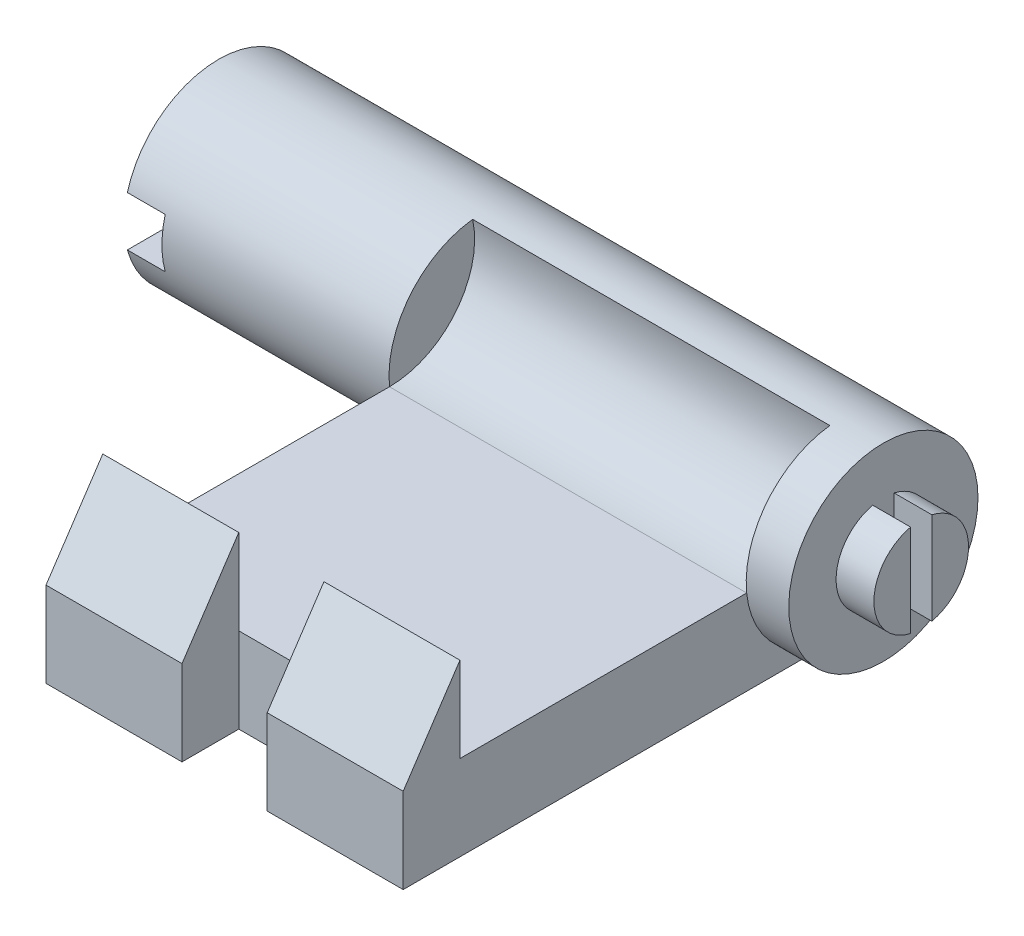
ISO-10303-21;
HEADER;
FILE_DESCRIPTION(('STEP AP214'),'2;1');
FILE_NAME('part.step','',(''),(''),'','','');
FILE_SCHEMA(('AUTOMOTIVE_DESIGN { 1 0 10303 214 1 1 1 1 }'));
ENDSEC;
DATA;
#1=APPLICATION_CONTEXT('core data for automotive mechanical design processes');
#2=APPLICATION_PROTOCOL_DEFINITION('international standard','automotive_design',2000,#1);
#3=PRODUCT_CONTEXT('',#1,'mechanical');
#4=PRODUCT('Part','Part','',(#3));
#5=PRODUCT_RELATED_PRODUCT_CATEGORY('part','',(#4));
#6=PRODUCT_DEFINITION_FORMATION('','',#4);
#7=PRODUCT_DEFINITION_CONTEXT('part definition',#1,'design');
#8=PRODUCT_DEFINITION('design','',#6,#7);
#9=PRODUCT_DEFINITION_SHAPE('','',#8);
#10=(LENGTH_UNIT() NAMED_UNIT(*) SI_UNIT(.MILLI.,.METRE.));
#11=(NAMED_UNIT(*) PLANE_ANGLE_UNIT() SI_UNIT($,.RADIAN.));
#12=(NAMED_UNIT(*) SI_UNIT($,.STERADIAN.) SOLID_ANGLE_UNIT());
#13=UNCERTAINTY_MEASURE_WITH_UNIT(LENGTH_MEASURE(1.E-05),#10,'distance_accuracy_value','');
#14=(GEOMETRIC_REPRESENTATION_CONTEXT(3) GLOBAL_UNCERTAINTY_ASSIGNED_CONTEXT((#13)) GLOBAL_UNIT_ASSIGNED_CONTEXT((#10,
#11,#12)) REPRESENTATION_CONTEXT('',''));
#15=CARTESIAN_POINT('',(0.,0.,0.));
#16=DIRECTION('',(0.,0.,1.));
#17=DIRECTION('',(1.,0.,0.));
#18=AXIS2_PLACEMENT_3D('',#15,#16,#17);
#19=CARTESIAN_POINT('',(38.354,0.,81.788));
#20=DIRECTION('',(0.,0.,-1.));
#21=DIRECTION('',(-1.,0.,0.));
#22=AXIS2_PLACEMENT_3D('',#19,#20,#21);
#23=PLANE('',#22);
#24=DIRECTION('',(-1.,0.,0.));
#25=VECTOR('',#24,1.);
#26=CARTESIAN_POINT('',(38.354,18.288,81.788));
#27=LINE('',#26,#25);
#28=CARTESIAN_POINT('',(38.354,18.288,81.788));
#29=VERTEX_POINT('',#28);
#30=CARTESIAN_POINT('',(9.14400000000001,18.288,81.788));
#31=VERTEX_POINT('',#30);
#32=EDGE_CURVE('E202',#29,#31,#27,.T.);
#33=ORIENTED_EDGE('',*,*,#32,.T.);
#34=DIRECTION('',(0.,1.,0.));
#35=VECTOR('',#34,1.);
#36=CARTESIAN_POINT('',(9.14400000000001,-5.00000000118461E-05,81.788));
#37=LINE('',#36,#35);
#38=CARTESIAN_POINT('',(9.14400000000001,36.576,81.788));
#39=VERTEX_POINT('',#38);
#40=EDGE_CURVE('E265',#31,#39,#37,.T.);
#41=ORIENTED_EDGE('',*,*,#40,.T.);
#42=DIRECTION('',(-1.,0.,0.));
#43=VECTOR('',#42,1.);
#44=CARTESIAN_POINT('',(38.354,36.576,81.788));
#45=LINE('',#44,#43);
#46=CARTESIAN_POINT('',(38.354,36.576,81.788));
#47=VERTEX_POINT('',#46);
#48=EDGE_CURVE('E203',#47,#39,#45,.T.);
#49=ORIENTED_EDGE('',*,*,#48,.F.);
#50=DIRECTION('',(0.,-1.,0.));
#51=VECTOR('',#50,1.);
#52=CARTESIAN_POINT('',(38.354,0.,81.788));
#53=LINE('',#52,#51);
#54=EDGE_CURVE('E328',#47,#29,#53,.T.);
#55=ORIENTED_EDGE('',*,*,#54,.T.);
#56=EDGE_LOOP('',(#33,#41,#49,#55));
#57=FACE_BOUND('',#56,.T.);
#58=ADVANCED_FACE('F35',(#57),#23,.T.);
#59=CARTESIAN_POINT('',(38.354,49.0024615384615,73.5036923076923));
#60=DIRECTION('',(0.,0.554700196225229,0.832050294337844));
#61=DIRECTION('',(0.,-0.832050294337844,0.554700196225229));
#62=AXIS2_PLACEMENT_3D('',#59,#60,#61);
#63=PLANE('',#62);
#64=ORIENTED_EDGE('',*,*,#48,.T.);
#65=DIRECTION('',(0.,-0.832050294337844,0.554700196225229));
#66=VECTOR('',#65,1.);
#67=CARTESIAN_POINT('',(9.14400000000001,49.0024615384615,73.5036923076923));
#68=LINE('',#67,#66);
#69=CARTESIAN_POINT('',(9.14400000000001,18.288,93.98));
#70=VERTEX_POINT('',#69);
#71=EDGE_CURVE('E270',#39,#70,#68,.T.);
#72=ORIENTED_EDGE('',*,*,#71,.T.);
#73=DIRECTION('',(-1.,0.,0.));
#74=VECTOR('',#73,1.);
#75=CARTESIAN_POINT('',(38.354,18.288,93.98));
#76=LINE('',#75,#74);
#77=CARTESIAN_POINT('',(38.354,18.288,93.98));
#78=VERTEX_POINT('',#77);
#79=EDGE_CURVE('E348',#78,#70,#76,.T.);
#80=ORIENTED_EDGE('',*,*,#79,.F.);
#81=DIRECTION('',(0.,0.832050294337844,-0.554700196225229));
#82=VECTOR('',#81,1.);
#83=CARTESIAN_POINT('',(38.354,49.0024615384615,73.5036923076923));
#84=LINE('',#83,#82);
#85=EDGE_CURVE('E332',#78,#47,#84,.T.);
#86=ORIENTED_EDGE('',*,*,#85,.T.);
#87=EDGE_LOOP('',(#64,#72,#80,#86));
#88=FACE_BOUND('',#87,.T.);
#89=ADVANCED_FACE('F428',(#88),#63,.T.);
#90=CARTESIAN_POINT('',(38.354,0.,93.98));
#91=DIRECTION('',(0.,0.,1.));
#92=DIRECTION('',(1.,0.,0.));
#93=AXIS2_PLACEMENT_3D('',#90,#91,#92);
#94=PLANE('',#93);
#95=ORIENTED_EDGE('',*,*,#79,.T.);
#96=DIRECTION('',(0.,1.,0.));
#97=VECTOR('',#96,1.);
#98=CARTESIAN_POINT('',(9.14400000000001,-5.00000000153156E-05,93.98));
#99=LINE('',#98,#97);
#100=CARTESIAN_POINT('',(9.14400000000001,0.,93.98));
#101=VERTEX_POINT('',#100);
#102=EDGE_CURVE('E180',#101,#70,#99,.T.);
#103=ORIENTED_EDGE('',*,*,#102,.F.);
#104=DIRECTION('',(-1.,0.,0.));
#105=VECTOR('',#104,1.);
#106=CARTESIAN_POINT('',(38.354,0.,93.98));
#107=LINE('',#106,#105);
#108=CARTESIAN_POINT('',(38.354,0.,93.98));
#109=VERTEX_POINT('',#108);
#110=EDGE_CURVE('E346',#109,#101,#107,.T.);
#111=ORIENTED_EDGE('',*,*,#110,.F.);
#112=DIRECTION('',(0.,1.,0.));
#113=VECTOR('',#112,1.);
#114=CARTESIAN_POINT('',(38.354,0.,93.98));
#115=LINE('',#114,#113);
#116=EDGE_CURVE('E236',#109,#78,#115,.T.);
#117=ORIENTED_EDGE('',*,*,#116,.T.);
#118=EDGE_LOOP('',(#95,#103,#111,#117));
#119=FACE_BOUND('',#118,.T.);
#120=ADVANCED_FACE('F433',(#119),#94,.T.);
#121=CARTESIAN_POINT('',(38.354,0.,0.));
#122=DIRECTION('',(0.,-1.,0.));
#123=DIRECTION('',(0.,0.,-1.));
#124=AXIS2_PLACEMENT_3D('',#121,#122,#123);
#125=PLANE('',#124);
#126=ORIENTED_EDGE('',*,*,#110,.T.);
#127=DIRECTION('',(0.,0.,-1.));
#128=VECTOR('',#127,1.);
#129=CARTESIAN_POINT('',(9.14400000000001,0.,0.));
#130=LINE('',#129,#128);
#131=CARTESIAN_POINT('',(9.14400000000001,0.,81.788));
#132=VERTEX_POINT('',#131);
#133=EDGE_CURVE('E11',#101,#132,#130,.T.);
#134=ORIENTED_EDGE('',*,*,#133,.T.);
#135=DIRECTION('',(-1.,0.,0.));
#136=VECTOR('',#135,1.);
#137=CARTESIAN_POINT('',(38.354,0.,81.788));
#138=LINE('',#137,#136);
#139=CARTESIAN_POINT('',(-9.14399999999999,0.,81.788));
#140=VERTEX_POINT('',#139);
#141=EDGE_CURVE('E250',#132,#140,#138,.T.);
#142=ORIENTED_EDGE('',*,*,#141,.T.);
#143=DIRECTION('',(0.,0.,-1.));
#144=VECTOR('',#143,1.);
#145=CARTESIAN_POINT('',(-9.14399999999999,0.,0.));
#146=LINE('',#145,#144);
#147=CARTESIAN_POINT('',(-9.14399999999999,0.,93.98));
#148=VERTEX_POINT('',#147);
#149=EDGE_CURVE('E43',#148,#140,#146,.T.);
#150=ORIENTED_EDGE('',*,*,#149,.F.);
#151=CARTESIAN_POINT('',(-38.354,0.,93.98));
#152=VERTEX_POINT('',#151);
#153=EDGE_CURVE('E229',#148,#152,#107,.T.);
#154=ORIENTED_EDGE('',*,*,#153,.T.);
#155=DIRECTION('',(0.,0.,1.));
#156=VECTOR('',#155,1.);
#157=CARTESIAN_POINT('',(-38.354,0.,0.));
#158=LINE('',#157,#156);
#159=CARTESIAN_POINT('',(-38.354,0.,0.));
#160=VERTEX_POINT('',#159);
#161=EDGE_CURVE('E251',#160,#152,#158,.T.);
#162=ORIENTED_EDGE('',*,*,#161,.F.);
#163=DIRECTION('',(-1.,0.,0.));
#164=VECTOR('',#163,1.);
#165=CARTESIAN_POINT('',(38.354,0.,0.));
#166=LINE('',#165,#164);
#167=CARTESIAN_POINT('',(38.354,0.,0.));
#168=VERTEX_POINT('',#167);
#169=EDGE_CURVE('E226',#168,#160,#166,.T.);
#170=ORIENTED_EDGE('',*,*,#169,.F.);
#171=DIRECTION('',(0.,0.,1.));
#172=VECTOR('',#171,1.);
#173=CARTESIAN_POINT('',(38.354,0.,0.));
#174=LINE('',#173,#172);
#175=EDGE_CURVE('E233',#168,#109,#174,.T.);
#176=ORIENTED_EDGE('',*,*,#175,.T.);
#177=EDGE_LOOP('',(#126,#134,#142,#150,#154,#162,#170,#176));
#178=FACE_BOUND('',#177,.T.);
#179=ADVANCED_FACE('F259',(#178),#125,.T.);
#180=CARTESIAN_POINT('',(38.354,20.32,0.));
#181=DIRECTION('',(-1.,0.,0.));
#182=DIRECTION('',(0.,0.,1.));
#183=AXIS2_PLACEMENT_3D('',#180,#181,#182);
#184=CYLINDRICAL_SURFACE('',#183,20.32);
#185=ORIENTED_EDGE('',*,*,#169,.T.);
#186=CARTESIAN_POINT('',(-38.354,20.32,0.));
#187=DIRECTION('',(1.,0.,0.));
#188=DIRECTION('',(0.,0.,-1.));
#189=AXIS2_PLACEMENT_3D('',#186,#187,#188);
#190=CIRCLE('',#189,20.32);
#191=CARTESIAN_POINT('',(-38.354,18.288,20.2181447220065));
#192=VERTEX_POINT('',#191);
#193=EDGE_CURVE('E224',#192,#160,#190,.T.);
#194=ORIENTED_EDGE('',*,*,#193,.F.);
#195=CARTESIAN_POINT('',(-38.354,40.5028711656442,2.35671625593942));
#196=VERTEX_POINT('',#195);
#197=EDGE_CURVE('E246',#196,#192,#190,.T.);
#198=ORIENTED_EDGE('',*,*,#197,.F.);
#199=DIRECTION('',(-1.,0.,0.));
#200=VECTOR('',#199,1.);
#201=CARTESIAN_POINT('',(38.354,40.5028711656442,2.35671625593942));
#202=LINE('',#201,#200);
#203=CARTESIAN_POINT('',(38.354,40.5028711656442,2.35671625593942));
#204=VERTEX_POINT('',#203);
#205=EDGE_CURVE('E230',#204,#196,#202,.T.);
#206=ORIENTED_EDGE('',*,*,#205,.F.);
#207=CARTESIAN_POINT('',(38.354,20.32,0.));
#208=DIRECTION('',(1.,0.,0.));
#209=DIRECTION('',(0.,0.,-1.));
#210=AXIS2_PLACEMENT_3D('',#207,#208,#209);
#211=CIRCLE('',#210,20.32);
#212=CARTESIAN_POINT('',(38.354,18.288,20.2181447220065));
#213=VERTEX_POINT('',#212);
#214=EDGE_CURVE('E217',#204,#213,#211,.T.);
#215=ORIENTED_EDGE('',*,*,#214,.T.);
#216=EDGE_CURVE('E205',#213,#168,#211,.T.);
#217=ORIENTED_EDGE('',*,*,#216,.T.);
#218=EDGE_LOOP('',(#185,#194,#198,#206,#215,#217));
#219=FACE_BOUND('',#218,.T.);
#220=CARTESIAN_POINT('',(47.498,20.32,0.));
#221=DIRECTION('',(1.,0.,0.));
#222=DIRECTION('',(0.,0.,-1.));
#223=AXIS2_PLACEMENT_3D('',#220,#221,#222);
#224=CIRCLE('',#223,20.32);
#225=CARTESIAN_POINT('',(47.498,20.32,-20.32));
#226=VERTEX_POINT('',#225);
#227=EDGE_CURVE('E325',#226,#226,#224,.T.);
#228=ORIENTED_EDGE('',*,*,#227,.F.);
#229=EDGE_LOOP('',(#228));
#230=FACE_BOUND('',#229,.T.);
#231=DIRECTION('',(-1.,0.,0.));
#232=VECTOR('',#231,1.);
#233=CARTESIAN_POINT('',(-87.122,25.654,-19.6074180860204));
#234=LINE('',#233,#232);
#235=CARTESIAN_POINT('',(-87.122,25.654,-19.6074180860204));
#236=VERTEX_POINT('',#235);
#237=CARTESIAN_POINT('',(-95.25,25.654,-19.6074180860204));
#238=VERTEX_POINT('',#237);
#239=EDGE_CURVE('E287',#236,#238,#234,.T.);
#240=ORIENTED_EDGE('',*,*,#239,.T.);
#241=CARTESIAN_POINT('',(-95.25,20.32,0.));
#242=DIRECTION('',(1.,0.,0.));
#243=DIRECTION('',(0.,0.,-1.));
#244=AXIS2_PLACEMENT_3D('',#241,#242,#243);
#245=CIRCLE('',#244,20.32);
#246=CARTESIAN_POINT('',(-95.25,25.654,19.6074180860204));
#247=VERTEX_POINT('',#246);
#248=EDGE_CURVE('E295',#238,#247,#245,.T.);
#249=ORIENTED_EDGE('',*,*,#248,.T.);
#250=DIRECTION('',(-1.,0.,0.));
#251=VECTOR('',#250,1.);
#252=CARTESIAN_POINT('',(-87.122,25.654,19.6074180860204));
#253=LINE('',#252,#251);
#254=CARTESIAN_POINT('',(-87.122,25.654,19.6074180860204));
#255=VERTEX_POINT('',#254);
#256=EDGE_CURVE('E290',#255,#247,#253,.T.);
#257=ORIENTED_EDGE('',*,*,#256,.F.);
#258=CARTESIAN_POINT('',(-87.122,20.32,0.));
#259=DIRECTION('',(-1.,0.,0.));
#260=DIRECTION('',(0.,0.,1.));
#261=AXIS2_PLACEMENT_3D('',#258,#259,#260);
#262=CIRCLE('',#261,20.32);
#263=CARTESIAN_POINT('',(-87.122,14.986,19.6074180860204));
#264=VERTEX_POINT('',#263);
#265=EDGE_CURVE('E279',#264,#255,#262,.T.);
#266=ORIENTED_EDGE('',*,*,#265,.F.);
#267=DIRECTION('',(-1.,0.,0.));
#268=VECTOR('',#267,1.);
#269=CARTESIAN_POINT('',(-87.122,14.986,19.6074180860204));
#270=LINE('',#269,#268);
#271=CARTESIAN_POINT('',(-95.25,14.986,19.6074180860204));
#272=VERTEX_POINT('',#271);
#273=EDGE_CURVE('E292',#264,#272,#270,.T.);
#274=ORIENTED_EDGE('',*,*,#273,.T.);
#275=CARTESIAN_POINT('',(-95.25,14.986,-19.6074180860204));
#276=VERTEX_POINT('',#275);
#277=EDGE_CURVE('E298',#272,#276,#245,.T.);
#278=ORIENTED_EDGE('',*,*,#277,.T.);
#279=DIRECTION('',(-1.,0.,0.));
#280=VECTOR('',#279,1.);
#281=CARTESIAN_POINT('',(-87.122,14.986,-19.6074180860204));
#282=LINE('',#281,#280);
#283=CARTESIAN_POINT('',(-87.122,14.986,-19.6074180860204));
#284=VERTEX_POINT('',#283);
#285=EDGE_CURVE('E58',#284,#276,#282,.T.);
#286=ORIENTED_EDGE('',*,*,#285,.F.);
#287=EDGE_CURVE('E274',#236,#284,#262,.T.);
#288=ORIENTED_EDGE('',*,*,#287,.F.);
#289=EDGE_LOOP('',(#240,#249,#257,#266,#274,#278,#286,#288));
#290=FACE_BOUND('',#289,.T.);
#291=ADVANCED_FACE('F365',(#219,#230,#290),#184,.T.);
#292=CARTESIAN_POINT('',(-95.25,0.,0.));
#293=DIRECTION('',(1.,0.,0.));
#294=DIRECTION('',(0.,0.,-1.));
#295=AXIS2_PLACEMENT_3D('',#292,#293,#294);
#296=PLANE('',#295);
#297=DIRECTION('',(0.,0.,1.));
#298=VECTOR('',#297,1.);
#299=CARTESIAN_POINT('',(-95.25,25.654,0.));
#300=LINE('',#299,#298);
#301=EDGE_CURVE('E278',#238,#247,#300,.T.);
#302=ORIENTED_EDGE('',*,*,#301,.T.);
#303=ORIENTED_EDGE('',*,*,#248,.F.);
#304=EDGE_LOOP('',(#302,#303));
#305=FACE_BOUND('',#304,.T.);
#306=ADVANCED_FACE('F414',(#305),#296,.F.);
#307=CARTESIAN_POINT('',(47.498,0.,0.));
#308=DIRECTION('',(1.,0.,0.));
#309=DIRECTION('',(0.,0.,-1.));
#310=AXIS2_PLACEMENT_3D('',#307,#308,#309);
#311=PLANE('',#310);
#312=ORIENTED_EDGE('',*,*,#227,.T.);
#313=EDGE_LOOP('',(#312));
#314=FACE_BOUND('',#313,.T.);
#315=DIRECTION('',(0.,1.,0.));
#316=VECTOR('',#315,1.);
#317=CARTESIAN_POINT('',(47.498,0.,-2.28599999999999));
#318=LINE('',#317,#316);
#319=CARTESIAN_POINT('',(47.498,10.4205149628882,-2.28599999999999));
#320=VERTEX_POINT('',#319);
#321=CARTESIAN_POINT('',(47.498,30.2194850371118,-2.28599999999999));
#322=VERTEX_POINT('',#321);
#323=EDGE_CURVE('E383',#320,#322,#318,.T.);
#324=ORIENTED_EDGE('',*,*,#323,.T.);
#325=CARTESIAN_POINT('',(47.498,20.32,0.));
#326=DIRECTION('',(1.,0.,0.));
#327=DIRECTION('',(0.,0.,-1.));
#328=AXIS2_PLACEMENT_3D('',#325,#326,#327);
#329=CIRCLE('',#328,10.16);
#330=EDGE_CURVE('E386',#320,#322,#329,.T.);
#331=ORIENTED_EDGE('',*,*,#330,.F.);
#332=EDGE_LOOP('',(#324,#331));
#333=FACE_BOUND('',#332,.T.);
#334=DIRECTION('',(0.,1.,0.));
#335=VECTOR('',#334,1.);
#336=CARTESIAN_POINT('',(47.498,0.,2.286));
#337=LINE('',#336,#335);
#338=CARTESIAN_POINT('',(47.498,10.4205149628882,2.286));
#339=VERTEX_POINT('',#338);
#340=CARTESIAN_POINT('',(47.498,30.2194850371118,2.286));
#341=VERTEX_POINT('',#340);
#342=EDGE_CURVE('E302',#339,#341,#337,.T.);
#343=ORIENTED_EDGE('',*,*,#342,.F.);
#344=CARTESIAN_POINT('',(47.498,20.32,0.));
#345=DIRECTION('',(1.,0.,0.));
#346=DIRECTION('',(0.,0.,-1.));
#347=AXIS2_PLACEMENT_3D('',#344,#345,#346);
#348=CIRCLE('',#347,10.16);
#349=EDGE_CURVE('E297',#341,#339,#348,.T.);
#350=ORIENTED_EDGE('',*,*,#349,.F.);
#351=EDGE_LOOP('',(#343,#350));
#352=FACE_BOUND('',#351,.T.);
#353=ADVANCED_FACE('F412',(#314,#333,#352),#311,.T.);
#354=CARTESIAN_POINT('',(38.354,18.288,0.));
#355=DIRECTION('',(0.,-1.,0.));
#356=DIRECTION('',(0.,0.,-1.));
#357=AXIS2_PLACEMENT_3D('',#354,#355,#356);
#358=PLANE('',#357);
#359=DIRECTION('',(0.,0.,1.));
#360=VECTOR('',#359,1.);
#361=CARTESIAN_POINT('',(-38.354,18.288,0.));
#362=LINE('',#361,#360);
#363=CARTESIAN_POINT('',(-38.354,18.288,81.788));
#364=VERTEX_POINT('',#363);
#365=EDGE_CURVE('E200',#192,#364,#362,.T.);
#366=ORIENTED_EDGE('',*,*,#365,.T.);
#367=CARTESIAN_POINT('',(-9.14399999999999,18.288,81.788));
#368=VERTEX_POINT('',#367);
#369=EDGE_CURVE('E195',#368,#364,#27,.T.);
#370=ORIENTED_EDGE('',*,*,#369,.F.);
#371=DIRECTION('',(-1.,0.,0.));
#372=VECTOR('',#371,1.);
#373=CARTESIAN_POINT('',(38.354,18.288,81.788));
#374=LINE('',#373,#372);
#375=EDGE_CURVE('E171',#31,#368,#374,.T.);
#376=ORIENTED_EDGE('',*,*,#375,.F.);
#377=ORIENTED_EDGE('',*,*,#32,.F.);
#378=DIRECTION('',(0.,0.,1.));
#379=VECTOR('',#378,1.);
#380=CARTESIAN_POINT('',(38.354,18.288,0.));
#381=LINE('',#380,#379);
#382=EDGE_CURVE('E317',#213,#29,#381,.T.);
#383=ORIENTED_EDGE('',*,*,#382,.F.);
#384=DIRECTION('',(-1.,0.,0.));
#385=VECTOR('',#384,1.);
#386=CARTESIAN_POINT('',(38.354,18.288,20.2181447220065));
#387=LINE('',#386,#385);
#388=EDGE_CURVE('E316',#213,#192,#387,.T.);
#389=ORIENTED_EDGE('',*,*,#388,.T.);
#390=EDGE_LOOP('',(#366,#370,#376,#377,#383,#389));
#391=FACE_BOUND('',#390,.T.);
#392=ADVANCED_FACE('F37',(#391),#358,.F.);
#393=DIRECTION('',(0.,1.,0.));
#394=VECTOR('',#393,1.);
#395=CARTESIAN_POINT('',(-9.14399999999999,-5.00000000118461E-05,81.788));
#396=LINE('',#395,#394);
#397=CARTESIAN_POINT('',(-9.14399999999999,36.576,81.788));
#398=VERTEX_POINT('',#397);
#399=EDGE_CURVE('E185',#368,#398,#396,.T.);
#400=ORIENTED_EDGE('',*,*,#399,.F.);
#401=ORIENTED_EDGE('',*,*,#369,.T.);
#402=DIRECTION('',(0.,-1.,0.));
#403=VECTOR('',#402,1.);
#404=CARTESIAN_POINT('',(-38.354,0.,81.788));
#405=LINE('',#404,#403);
#406=CARTESIAN_POINT('',(-38.354,36.576,81.788));
#407=VERTEX_POINT('',#406);
#408=EDGE_CURVE('E324',#407,#364,#405,.T.);
#409=ORIENTED_EDGE('',*,*,#408,.F.);
#410=EDGE_CURVE('E197',#398,#407,#45,.T.);
#411=ORIENTED_EDGE('',*,*,#410,.F.);
#412=EDGE_LOOP('',(#400,#401,#409,#411));
#413=FACE_BOUND('',#412,.T.);
#414=ADVANCED_FACE('F193',(#413),#23,.T.);
#415=DIRECTION('',(0.,-0.832050294337844,0.554700196225229));
#416=VECTOR('',#415,1.);
#417=CARTESIAN_POINT('',(-9.14399999999999,49.0024615384615,73.5036923076923));
#418=LINE('',#417,#416);
#419=CARTESIAN_POINT('',(-9.14399999999999,18.288,93.98));
#420=VERTEX_POINT('',#419);
#421=EDGE_CURVE('E179',#398,#420,#418,.T.);
#422=ORIENTED_EDGE('',*,*,#421,.F.);
#423=ORIENTED_EDGE('',*,*,#410,.T.);
#424=DIRECTION('',(0.,0.832050294337844,-0.554700196225229));
#425=VECTOR('',#424,1.);
#426=CARTESIAN_POINT('',(-38.354,49.0024615384615,73.5036923076923));
#427=LINE('',#426,#425);
#428=CARTESIAN_POINT('',(-38.354,18.288,93.98));
#429=VERTEX_POINT('',#428);
#430=EDGE_CURVE('E341',#429,#407,#427,.T.);
#431=ORIENTED_EDGE('',*,*,#430,.F.);
#432=EDGE_CURVE('E347',#420,#429,#76,.T.);
#433=ORIENTED_EDGE('',*,*,#432,.F.);
#434=EDGE_LOOP('',(#422,#423,#431,#433));
#435=FACE_BOUND('',#434,.T.);
#436=ADVANCED_FACE('F358',(#435),#63,.T.);
#437=DIRECTION('',(0.,1.,0.));
#438=VECTOR('',#437,1.);
#439=CARTESIAN_POINT('',(-9.14399999999999,-5.00000000153156E-05,93.98));
#440=LINE('',#439,#438);
#441=EDGE_CURVE('E189',#148,#420,#440,.T.);
#442=ORIENTED_EDGE('',*,*,#441,.T.);
#443=ORIENTED_EDGE('',*,*,#432,.T.);
#444=DIRECTION('',(0.,1.,0.));
#445=VECTOR('',#444,1.);
#446=CARTESIAN_POINT('',(-38.354,0.,93.98));
#447=LINE('',#446,#445);
#448=EDGE_CURVE('E254',#152,#429,#447,.T.);
#449=ORIENTED_EDGE('',*,*,#448,.F.);
#450=ORIENTED_EDGE('',*,*,#153,.F.);
#451=EDGE_LOOP('',(#442,#443,#449,#450));
#452=FACE_BOUND('',#451,.T.);
#453=ADVANCED_FACE('F356',(#452),#94,.T.);
#454=CARTESIAN_POINT('',(38.354,36.576,20.2181447220065));
#455=DIRECTION('',(-1.,0.,0.));
#456=DIRECTION('',(0.,0.,1.));
#457=AXIS2_PLACEMENT_3D('',#454,#455,#456);
#458=CYLINDRICAL_SURFACE('',#457,18.288);
#459=CARTESIAN_POINT('',(-38.354,36.576,20.2181447220065));
#460=DIRECTION('',(1.,0.,0.));
#461=DIRECTION('',(0.,0.,-1.));
#462=AXIS2_PLACEMENT_3D('',#459,#460,#461);
#463=CIRCLE('',#462,18.288);
#464=EDGE_CURVE('E241',#192,#196,#463,.T.);
#465=ORIENTED_EDGE('',*,*,#464,.F.);
#466=ORIENTED_EDGE('',*,*,#388,.F.);
#467=CARTESIAN_POINT('',(38.354,36.576,20.2181447220065));
#468=DIRECTION('',(1.,0.,0.));
#469=DIRECTION('',(0.,0.,-1.));
#470=AXIS2_PLACEMENT_3D('',#467,#468,#469);
#471=CIRCLE('',#470,18.288);
#472=EDGE_CURVE('E212',#213,#204,#471,.T.);
#473=ORIENTED_EDGE('',*,*,#472,.T.);
#474=ORIENTED_EDGE('',*,*,#205,.T.);
#475=EDGE_LOOP('',(#465,#466,#473,#474));
#476=FACE_BOUND('',#475,.T.);
#477=ADVANCED_FACE('F327',(#476),#458,.F.);
#478=CARTESIAN_POINT('',(38.354,0.,0.));
#479=DIRECTION('',(1.,0.,0.));
#480=DIRECTION('',(0.,0.,-1.));
#481=AXIS2_PLACEMENT_3D('',#478,#479,#480);
#482=PLANE('',#481);
#483=ORIENTED_EDGE('',*,*,#216,.F.);
#484=ORIENTED_EDGE('',*,*,#382,.T.);
#485=ORIENTED_EDGE('',*,*,#54,.F.);
#486=ORIENTED_EDGE('',*,*,#85,.F.);
#487=ORIENTED_EDGE('',*,*,#116,.F.);
#488=ORIENTED_EDGE('',*,*,#175,.F.);
#489=EDGE_LOOP('',(#483,#484,#485,#486,#487,#488));
#490=FACE_BOUND('',#489,.T.);
#491=ADVANCED_FACE('F362',(#490),#482,.T.);
#492=CARTESIAN_POINT('',(-38.354,0.,0.));
#493=DIRECTION('',(1.,0.,0.));
#494=DIRECTION('',(0.,0.,-1.));
#495=AXIS2_PLACEMENT_3D('',#492,#493,#494);
#496=PLANE('',#495);
#497=ORIENTED_EDGE('',*,*,#365,.F.);
#498=ORIENTED_EDGE('',*,*,#193,.T.);
#499=ORIENTED_EDGE('',*,*,#161,.T.);
#500=ORIENTED_EDGE('',*,*,#448,.T.);
#501=ORIENTED_EDGE('',*,*,#430,.T.);
#502=ORIENTED_EDGE('',*,*,#408,.T.);
#503=EDGE_LOOP('',(#497,#498,#499,#500,#501,#502));
#504=FACE_BOUND('',#503,.T.);
#505=ADVANCED_FACE('F322',(#504),#496,.F.);
#506=CARTESIAN_POINT('',(38.354,0.,0.));
#507=DIRECTION('',(1.,0.,0.));
#508=DIRECTION('',(0.,0.,-1.));
#509=AXIS2_PLACEMENT_3D('',#506,#507,#508);
#510=PLANE('',#509);
#511=ORIENTED_EDGE('',*,*,#472,.F.);
#512=ORIENTED_EDGE('',*,*,#214,.F.);
#513=EDGE_LOOP('',(#511,#512));
#514=FACE_BOUND('',#513,.T.);
#515=ADVANCED_FACE('F453',(#514),#510,.F.);
#516=CARTESIAN_POINT('',(55.626,20.32,0.));
#517=DIRECTION('',(-1.,0.,0.));
#518=DIRECTION('',(0.,0.,1.));
#519=AXIS2_PLACEMENT_3D('',#516,#517,#518);
#520=CYLINDRICAL_SURFACE('',#519,10.16);
#521=ORIENTED_EDGE('',*,*,#330,.T.);
#522=DIRECTION('',(-1.,0.,0.));
#523=VECTOR('',#522,1.);
#524=CARTESIAN_POINT('',(55.626,30.2194850371118,-2.28599999999999));
#525=LINE('',#524,#523);
#526=CARTESIAN_POINT('',(55.626,30.2194850371118,-2.28599999999999));
#527=VERTEX_POINT('',#526);
#528=EDGE_CURVE('E369',#527,#322,#525,.T.);
#529=ORIENTED_EDGE('',*,*,#528,.F.);
#530=CARTESIAN_POINT('',(55.626,20.32,0.));
#531=DIRECTION('',(1.,0.,0.));
#532=DIRECTION('',(0.,0.,-1.));
#533=AXIS2_PLACEMENT_3D('',#530,#531,#532);
#534=CIRCLE('',#533,10.16);
#535=CARTESIAN_POINT('',(55.626,10.4205149628882,-2.28599999999999));
#536=VERTEX_POINT('',#535);
#537=EDGE_CURVE('E385',#536,#527,#534,.T.);
#538=ORIENTED_EDGE('',*,*,#537,.F.);
#539=DIRECTION('',(-1.,0.,0.));
#540=VECTOR('',#539,1.);
#541=CARTESIAN_POINT('',(55.626,10.4205149628882,-2.28599999999999));
#542=LINE('',#541,#540);
#543=EDGE_CURVE('E372',#536,#320,#542,.T.);
#544=ORIENTED_EDGE('',*,*,#543,.T.);
#545=EDGE_LOOP('',(#521,#529,#538,#544));
#546=FACE_BOUND('',#545,.T.);
#547=ADVANCED_FACE('F456',(#546),#520,.T.);
#548=CARTESIAN_POINT('',(55.626,0.,-2.28599999999999));
#549=DIRECTION('',(0.,0.,1.));
#550=DIRECTION('',(0.,-1.,0.));
#551=AXIS2_PLACEMENT_3D('',#548,#549,#550);
#552=PLANE('',#551);
#553=ORIENTED_EDGE('',*,*,#323,.F.);
#554=ORIENTED_EDGE('',*,*,#543,.F.);
#555=DIRECTION('',(0.,1.,0.));
#556=VECTOR('',#555,1.);
#557=CARTESIAN_POINT('',(55.626,0.,-2.28599999999999));
#558=LINE('',#557,#556);
#559=EDGE_CURVE('E380',#536,#527,#558,.T.);
#560=ORIENTED_EDGE('',*,*,#559,.T.);
#561=ORIENTED_EDGE('',*,*,#528,.T.);
#562=EDGE_LOOP('',(#553,#554,#560,#561));
#563=FACE_BOUND('',#562,.T.);
#564=ADVANCED_FACE('F460',(#563),#552,.T.);
#565=CARTESIAN_POINT('',(55.626,20.32,0.));
#566=DIRECTION('',(1.,0.,0.));
#567=DIRECTION('',(0.,0.,-1.));
#568=AXIS2_PLACEMENT_3D('',#565,#566,#567);
#569=PLANE('',#568);
#570=ORIENTED_EDGE('',*,*,#537,.T.);
#571=ORIENTED_EDGE('',*,*,#559,.F.);
#572=EDGE_LOOP('',(#570,#571));
#573=FACE_BOUND('',#572,.T.);
#574=ADVANCED_FACE('F465',(#573),#569,.T.);
#575=CARTESIAN_POINT('',(55.626,20.32,0.));
#576=DIRECTION('',(-1.,0.,0.));
#577=DIRECTION('',(0.,0.,1.));
#578=AXIS2_PLACEMENT_3D('',#575,#576,#577);
#579=CYLINDRICAL_SURFACE('',#578,10.16);
#580=ORIENTED_EDGE('',*,*,#349,.T.);
#581=DIRECTION('',(-1.,0.,0.));
#582=VECTOR('',#581,1.);
#583=CARTESIAN_POINT('',(55.626,10.4205149628882,2.286));
#584=LINE('',#583,#582);
#585=CARTESIAN_POINT('',(55.626,10.4205149628882,2.286));
#586=VERTEX_POINT('',#585);
#587=EDGE_CURVE('E388',#586,#339,#584,.T.);
#588=ORIENTED_EDGE('',*,*,#587,.F.);
#589=CARTESIAN_POINT('',(55.626,20.32,0.));
#590=DIRECTION('',(1.,0.,0.));
#591=DIRECTION('',(0.,0.,-1.));
#592=AXIS2_PLACEMENT_3D('',#589,#590,#591);
#593=CIRCLE('',#592,10.16);
#594=CARTESIAN_POINT('',(55.626,30.2194850371118,2.286));
#595=VERTEX_POINT('',#594);
#596=EDGE_CURVE('E397',#595,#586,#593,.T.);
#597=ORIENTED_EDGE('',*,*,#596,.F.);
#598=DIRECTION('',(-1.,0.,0.));
#599=VECTOR('',#598,1.);
#600=CARTESIAN_POINT('',(55.626,30.2194850371118,2.286));
#601=LINE('',#600,#599);
#602=EDGE_CURVE('E393',#595,#341,#601,.T.);
#603=ORIENTED_EDGE('',*,*,#602,.T.);
#604=EDGE_LOOP('',(#580,#588,#597,#603));
#605=FACE_BOUND('',#604,.T.);
#606=ADVANCED_FACE('F406',(#605),#579,.T.);
#607=CARTESIAN_POINT('',(55.626,0.,2.286));
#608=DIRECTION('',(0.,0.,1.));
#609=DIRECTION('',(0.,-1.,0.));
#610=AXIS2_PLACEMENT_3D('',#607,#608,#609);
#611=PLANE('',#610);
#612=ORIENTED_EDGE('',*,*,#342,.T.);
#613=ORIENTED_EDGE('',*,*,#602,.F.);
#614=DIRECTION('',(0.,1.,0.));
#615=VECTOR('',#614,1.);
#616=CARTESIAN_POINT('',(55.626,0.,2.286));
#617=LINE('',#616,#615);
#618=EDGE_CURVE('E396',#586,#595,#617,.T.);
#619=ORIENTED_EDGE('',*,*,#618,.F.);
#620=ORIENTED_EDGE('',*,*,#587,.T.);
#621=EDGE_LOOP('',(#612,#613,#619,#620));
#622=FACE_BOUND('',#621,.T.);
#623=ADVANCED_FACE('F410',(#622),#611,.F.);
#624=CARTESIAN_POINT('',(55.626,20.32,0.));
#625=DIRECTION('',(1.,0.,0.));
#626=DIRECTION('',(0.,0.,-1.));
#627=AXIS2_PLACEMENT_3D('',#624,#625,#626);
#628=PLANE('',#627);
#629=ORIENTED_EDGE('',*,*,#596,.T.);
#630=ORIENTED_EDGE('',*,*,#618,.T.);
#631=EDGE_LOOP('',(#629,#630));
#632=FACE_BOUND('',#631,.T.);
#633=ADVANCED_FACE('F403',(#632),#628,.T.);
#634=ORIENTED_EDGE('',*,*,#277,.F.);
#635=DIRECTION('',(0.,0.,1.));
#636=VECTOR('',#635,1.);
#637=CARTESIAN_POINT('',(-95.25,14.986,0.));
#638=LINE('',#637,#636);
#639=EDGE_CURVE('E273',#276,#272,#638,.T.);
#640=ORIENTED_EDGE('',*,*,#639,.F.);
#641=EDGE_LOOP('',(#634,#640));
#642=FACE_BOUND('',#641,.T.);
#643=ADVANCED_FACE('F423',(#642),#296,.F.);
#644=CARTESIAN_POINT('',(-38.354,0.,0.));
#645=DIRECTION('',(1.,0.,0.));
#646=DIRECTION('',(0.,0.,-1.));
#647=AXIS2_PLACEMENT_3D('',#644,#645,#646);
#648=PLANE('',#647);
#649=ORIENTED_EDGE('',*,*,#197,.T.);
#650=ORIENTED_EDGE('',*,*,#464,.T.);
#651=EDGE_LOOP('',(#649,#650));
#652=FACE_BOUND('',#651,.T.);
#653=ADVANCED_FACE('F309',(#652),#648,.T.);
#654=CARTESIAN_POINT('',(-87.122,25.654,0.));
#655=DIRECTION('',(0.,-1.,0.));
#656=DIRECTION('',(0.,0.,-1.));
#657=AXIS2_PLACEMENT_3D('',#654,#655,#656);
#658=PLANE('',#657);
#659=ORIENTED_EDGE('',*,*,#301,.F.);
#660=ORIENTED_EDGE('',*,*,#239,.F.);
#661=DIRECTION('',(0.,0.,1.));
#662=VECTOR('',#661,1.);
#663=CARTESIAN_POINT('',(-87.122,25.654,0.));
#664=LINE('',#663,#662);
#665=EDGE_CURVE('E282',#236,#255,#664,.T.);
#666=ORIENTED_EDGE('',*,*,#665,.T.);
#667=ORIENTED_EDGE('',*,*,#256,.T.);
#668=EDGE_LOOP('',(#659,#660,#666,#667));
#669=FACE_BOUND('',#668,.T.);
#670=ADVANCED_FACE('F478',(#669),#658,.T.);
#671=CARTESIAN_POINT('',(-87.122,14.986,0.));
#672=DIRECTION('',(0.,-1.,0.));
#673=DIRECTION('',(0.,0.,-1.));
#674=AXIS2_PLACEMENT_3D('',#671,#672,#673);
#675=PLANE('',#674);
#676=ORIENTED_EDGE('',*,*,#639,.T.);
#677=ORIENTED_EDGE('',*,*,#273,.F.);
#678=DIRECTION('',(0.,0.,1.));
#679=VECTOR('',#678,1.);
#680=CARTESIAN_POINT('',(-87.122,14.986,0.));
#681=LINE('',#680,#679);
#682=EDGE_CURVE('E277',#284,#264,#681,.T.);
#683=ORIENTED_EDGE('',*,*,#682,.F.);
#684=ORIENTED_EDGE('',*,*,#285,.T.);
#685=EDGE_LOOP('',(#676,#677,#683,#684));
#686=FACE_BOUND('',#685,.T.);
#687=ADVANCED_FACE('F482',(#686),#675,.F.);
#688=CARTESIAN_POINT('',(-87.122,0.,0.));
#689=DIRECTION('',(-1.,0.,0.));
#690=DIRECTION('',(0.,0.,1.));
#691=AXIS2_PLACEMENT_3D('',#688,#689,#690);
#692=PLANE('',#691);
#693=ORIENTED_EDGE('',*,*,#287,.T.);
#694=ORIENTED_EDGE('',*,*,#682,.T.);
#695=ORIENTED_EDGE('',*,*,#265,.T.);
#696=ORIENTED_EDGE('',*,*,#665,.F.);
#697=EDGE_LOOP('',(#693,#694,#695,#696));
#698=FACE_BOUND('',#697,.T.);
#699=ADVANCED_FACE('F485',(#698),#692,.T.);
#700=CARTESIAN_POINT('',(0.,-5.00000000118461E-05,81.788));
#701=DIRECTION('',(0.,0.,1.));
#702=DIRECTION('',(0.,-1.,0.));
#703=AXIS2_PLACEMENT_3D('',#700,#701,#702);
#704=PLANE('',#703);
#705=ORIENTED_EDGE('',*,*,#375,.T.);
#706=EDGE_CURVE('E50',#140,#368,#396,.T.);
#707=ORIENTED_EDGE('',*,*,#706,.F.);
#708=ORIENTED_EDGE('',*,*,#141,.F.);
#709=EDGE_CURVE('E174',#132,#31,#37,.T.);
#710=ORIENTED_EDGE('',*,*,#709,.T.);
#711=EDGE_LOOP('',(#705,#707,#708,#710));
#712=FACE_BOUND('',#711,.T.);
#713=ADVANCED_FACE('F172',(#712),#704,.T.);
#714=CARTESIAN_POINT('',(9.14400000000001,-5.00000000014378E-05,0.));
#715=DIRECTION('',(-1.,0.,0.));
#716=DIRECTION('',(0.,0.,1.));
#717=AXIS2_PLACEMENT_3D('',#714,#715,#716);
#718=PLANE('',#717);
#719=ORIENTED_EDGE('',*,*,#40,.F.);
#720=ORIENTED_EDGE('',*,*,#709,.F.);
#721=ORIENTED_EDGE('',*,*,#133,.F.);
#722=ORIENTED_EDGE('',*,*,#102,.T.);
#723=ORIENTED_EDGE('',*,*,#71,.F.);
#724=EDGE_LOOP('',(#719,#720,#721,#722,#723));
#725=FACE_BOUND('',#724,.T.);
#726=ADVANCED_FACE('F262',(#725),#718,.T.);
#727=CARTESIAN_POINT('',(-9.14399999999999,-5.00000000014378E-05,0.));
#728=DIRECTION('',(-1.,0.,0.));
#729=DIRECTION('',(0.,0.,1.));
#730=AXIS2_PLACEMENT_3D('',#727,#728,#729);
#731=PLANE('',#730);
#732=ORIENTED_EDGE('',*,*,#421,.T.);
#733=ORIENTED_EDGE('',*,*,#441,.F.);
#734=ORIENTED_EDGE('',*,*,#149,.T.);
#735=ORIENTED_EDGE('',*,*,#706,.T.);
#736=ORIENTED_EDGE('',*,*,#399,.T.);
#737=EDGE_LOOP('',(#732,#733,#734,#735,#736));
#738=FACE_BOUND('',#737,.T.);
#739=ADVANCED_FACE('F184',(#738),#731,.F.);
#740=CLOSED_SHELL('',(#58,#89,#120,#179,#291,#306,#353,#392,#414,#436,#453,#477,#491,#505,#515,
#547,#564,#574,#606,#623,#633,#643,#653,#670,#687,#699,#713,#726,#739));
#741=MANIFOLD_SOLID_BREP('B2',#740);
#742=ADVANCED_BREP_SHAPE_REPRESENTATION('',(#18,#741),#14);
#743=SHAPE_DEFINITION_REPRESENTATION(#9,#742);
ENDSEC;
END-ISO-10303-21;
